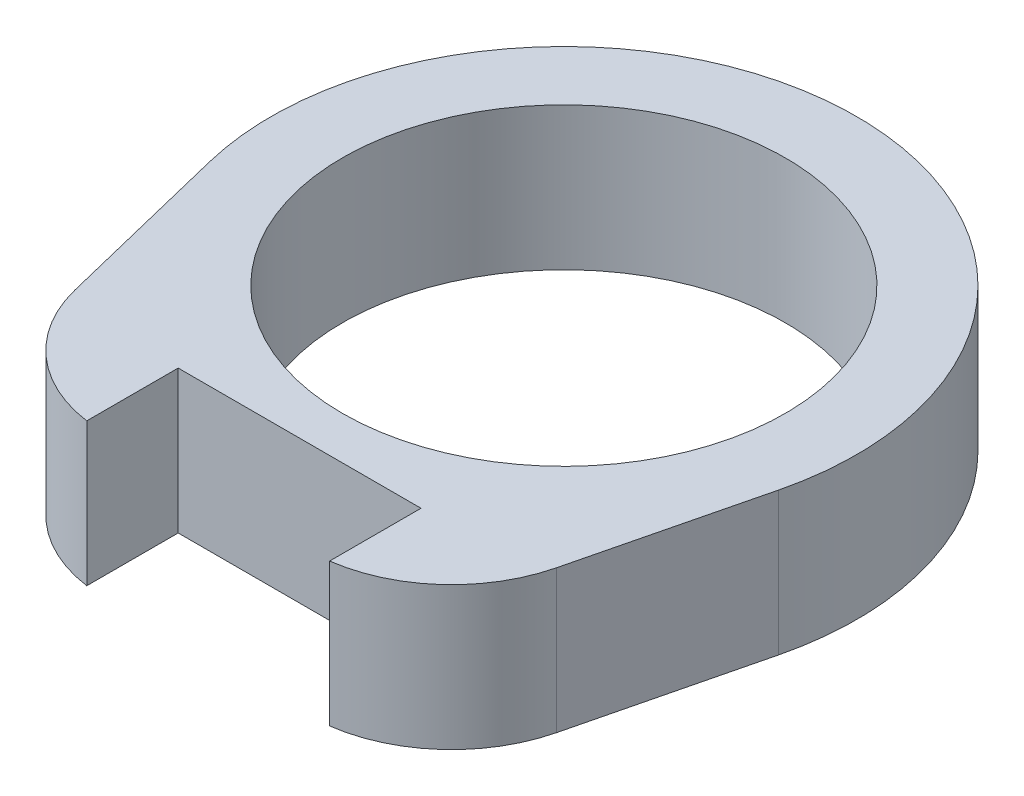
ISO-10303-21;
HEADER;
FILE_DESCRIPTION(('STEP AP214'),'2;1');
FILE_NAME('part.step','',(''),(''),'','','');
FILE_SCHEMA(('AUTOMOTIVE_DESIGN { 1 0 10303 214 1 1 1 1 }'));
ENDSEC;
DATA;
#1=APPLICATION_CONTEXT('core data for automotive mechanical design processes');
#2=APPLICATION_PROTOCOL_DEFINITION('international standard','automotive_design',2000,#1);
#3=PRODUCT_CONTEXT('',#1,'mechanical');
#4=PRODUCT('Part','Part','',(#3));
#5=PRODUCT_RELATED_PRODUCT_CATEGORY('part','',(#4));
#6=PRODUCT_DEFINITION_FORMATION('','',#4);
#7=PRODUCT_DEFINITION_CONTEXT('part definition',#1,'design');
#8=PRODUCT_DEFINITION('design','',#6,#7);
#9=PRODUCT_DEFINITION_SHAPE('','',#8);
#10=(LENGTH_UNIT() NAMED_UNIT(*) SI_UNIT(.MILLI.,.METRE.));
#11=(NAMED_UNIT(*) PLANE_ANGLE_UNIT() SI_UNIT($,.RADIAN.));
#12=(NAMED_UNIT(*) SI_UNIT($,.STERADIAN.) SOLID_ANGLE_UNIT());
#13=UNCERTAINTY_MEASURE_WITH_UNIT(LENGTH_MEASURE(1.E-05),#10,'distance_accuracy_value','');
#14=(GEOMETRIC_REPRESENTATION_CONTEXT(3) GLOBAL_UNCERTAINTY_ASSIGNED_CONTEXT((#13)) GLOBAL_UNIT_ASSIGNED_CONTEXT((#10,
#11,#12)) REPRESENTATION_CONTEXT('',''));
#15=CARTESIAN_POINT('',(0.,0.,0.));
#16=DIRECTION('',(0.,0.,1.));
#17=DIRECTION('',(1.,0.,0.));
#18=AXIS2_PLACEMENT_3D('',#15,#16,#17);
#19=CARTESIAN_POINT('',(-8.5,0.,24.9));
#20=DIRECTION('',(-1.,0.,0.));
#21=DIRECTION('',(0.,0.,-1.));
#22=AXIS2_PLACEMENT_3D('',#19,#20,#21);
#23=PLANE('',#22);
#24=DIRECTION('',(0.,1.,0.));
#25=VECTOR('',#24,1.);
#26=CARTESIAN_POINT('',(-8.5,0.,24.9));
#27=LINE('',#26,#25);
#28=CARTESIAN_POINT('',(-8.5,-10.,24.9));
#29=VERTEX_POINT('',#28);
#30=CARTESIAN_POINT('',(-8.5,0.,24.9));
#31=VERTEX_POINT('',#30);
#32=EDGE_CURVE('E11',#29,#31,#27,.T.);
#33=ORIENTED_EDGE('',*,*,#32,.F.);
#34=DIRECTION('',(0.,0.,-1.));
#35=VECTOR('',#34,1.);
#36=CARTESIAN_POINT('',(-8.5,-10.,0.));
#37=LINE('',#36,#35);
#38=CARTESIAN_POINT('',(-8.5,-10.,18.5));
#39=VERTEX_POINT('',#38);
#40=EDGE_CURVE('E113',#29,#39,#37,.T.);
#41=ORIENTED_EDGE('',*,*,#40,.T.);
#42=DIRECTION('',(0.,1.,0.));
#43=VECTOR('',#42,1.);
#44=CARTESIAN_POINT('',(-8.5,0.,18.5));
#45=LINE('',#44,#43);
#46=CARTESIAN_POINT('',(-8.5,0.,18.5));
#47=VERTEX_POINT('',#46);
#48=EDGE_CURVE('E55',#39,#47,#45,.T.);
#49=ORIENTED_EDGE('',*,*,#48,.T.);
#50=DIRECTION('',(0.,0.,-1.));
#51=VECTOR('',#50,1.);
#52=CARTESIAN_POINT('',(-8.5,0.,24.9));
#53=LINE('',#52,#51);
#54=EDGE_CURVE('E171',#31,#47,#53,.T.);
#55=ORIENTED_EDGE('',*,*,#54,.F.);
#56=EDGE_LOOP('',(#33,#41,#49,#55));
#57=FACE_BOUND('',#56,.T.);
#58=ADVANCED_FACE('F44',(#57),#23,.F.);
#59=CARTESIAN_POINT('',(-8.5,0.,18.5));
#60=DIRECTION('',(0.,0.,-1.));
#61=DIRECTION('',(1.,0.,0.));
#62=AXIS2_PLACEMENT_3D('',#59,#60,#61);
#63=PLANE('',#62);
#64=ORIENTED_EDGE('',*,*,#48,.F.);
#65=DIRECTION('',(1.,0.,0.));
#66=VECTOR('',#65,1.);
#67=CARTESIAN_POINT('',(0.,-10.,18.5));
#68=LINE('',#67,#66);
#69=CARTESIAN_POINT('',(8.5,-10.,18.5));
#70=VERTEX_POINT('',#69);
#71=EDGE_CURVE('E142',#39,#70,#68,.T.);
#72=ORIENTED_EDGE('',*,*,#71,.T.);
#73=DIRECTION('',(0.,1.,0.));
#74=VECTOR('',#73,1.);
#75=CARTESIAN_POINT('',(8.5,0.,18.5));
#76=LINE('',#75,#74);
#77=CARTESIAN_POINT('',(8.5,0.,18.5));
#78=VERTEX_POINT('',#77);
#79=EDGE_CURVE('E161',#70,#78,#76,.T.);
#80=ORIENTED_EDGE('',*,*,#79,.T.);
#81=DIRECTION('',(1.,0.,0.));
#82=VECTOR('',#81,1.);
#83=CARTESIAN_POINT('',(-8.5,0.,18.5));
#84=LINE('',#83,#82);
#85=EDGE_CURVE('E180',#47,#78,#84,.T.);
#86=ORIENTED_EDGE('',*,*,#85,.F.);
#87=EDGE_LOOP('',(#64,#72,#80,#86));
#88=FACE_BOUND('',#87,.T.);
#89=ADVANCED_FACE('F184',(#88),#63,.F.);
#90=CARTESIAN_POINT('',(8.5,0.,18.5));
#91=DIRECTION('',(1.,0.,0.));
#92=DIRECTION('',(0.,0.,1.));
#93=AXIS2_PLACEMENT_3D('',#90,#91,#92);
#94=PLANE('',#93);
#95=ORIENTED_EDGE('',*,*,#79,.F.);
#96=DIRECTION('',(0.,0.,-1.));
#97=VECTOR('',#96,1.);
#98=CARTESIAN_POINT('',(8.5,-10.,0.));
#99=LINE('',#98,#97);
#100=CARTESIAN_POINT('',(8.5,-10.,24.9));
#101=VERTEX_POINT('',#100);
#102=EDGE_CURVE('E138',#70,#101,#99,.F.);
#103=ORIENTED_EDGE('',*,*,#102,.T.);
#104=DIRECTION('',(0.,1.,0.));
#105=VECTOR('',#104,1.);
#106=CARTESIAN_POINT('',(8.5,0.,24.9));
#107=LINE('',#106,#105);
#108=CARTESIAN_POINT('',(8.5,0.,24.9));
#109=VERTEX_POINT('',#108);
#110=EDGE_CURVE('E157',#101,#109,#107,.T.);
#111=ORIENTED_EDGE('',*,*,#110,.T.);
#112=DIRECTION('',(0.,0.,1.));
#113=VECTOR('',#112,1.);
#114=CARTESIAN_POINT('',(8.5,0.,18.5));
#115=LINE('',#114,#113);
#116=EDGE_CURVE('E186',#78,#109,#115,.T.);
#117=ORIENTED_EDGE('',*,*,#116,.F.);
#118=EDGE_LOOP('',(#95,#103,#111,#117));
#119=FACE_BOUND('',#118,.T.);
#120=ADVANCED_FACE('F216',(#119),#94,.F.);
#121=CARTESIAN_POINT('',(7.13344069003477,0.,14.9938142732761));
#122=DIRECTION('',(0.,-1.,0.));
#123=DIRECTION('',(0.,0.,-1.));
#124=AXIS2_PLACEMENT_3D('',#121,#122,#123);
#125=CYLINDRICAL_SURFACE('',#124,10.);
#126=ORIENTED_EDGE('',*,*,#110,.F.);
#127=CARTESIAN_POINT('',(7.13344069003477,-10.,14.9938142732761));
#128=DIRECTION('',(0.,-1.,0.));
#129=DIRECTION('',(0.,0.,-1.));
#130=AXIS2_PLACEMENT_3D('',#127,#128,#129);
#131=CIRCLE('',#130,10.);
#132=CARTESIAN_POINT('',(16.8455351105988,-10.,17.3760867106874));
#133=VERTEX_POINT('',#132);
#134=EDGE_CURVE('E134',#101,#133,#131,.F.);
#135=ORIENTED_EDGE('',*,*,#134,.T.);
#136=DIRECTION('',(0.,1.,0.));
#137=VECTOR('',#136,1.);
#138=CARTESIAN_POINT('',(16.8455351105988,0.,17.3760867106874));
#139=LINE('',#138,#137);
#140=CARTESIAN_POINT('',(16.8455351105988,0.,17.3760867106874));
#141=VERTEX_POINT('',#140);
#142=EDGE_CURVE('E153',#133,#141,#139,.T.);
#143=ORIENTED_EDGE('',*,*,#142,.T.);
#144=CARTESIAN_POINT('',(7.13344069003477,0.,14.9938142732761));
#145=DIRECTION('',(0.,-1.,0.));
#146=DIRECTION('',(0.,0.,-1.));
#147=AXIS2_PLACEMENT_3D('',#144,#145,#146);
#148=CIRCLE('',#147,10.);
#149=EDGE_CURVE('E190',#109,#141,#148,.F.);
#150=ORIENTED_EDGE('',*,*,#149,.F.);
#151=EDGE_LOOP('',(#126,#135,#143,#150));
#152=FACE_BOUND('',#151,.T.);
#153=ADVANCED_FACE('F212',(#152),#125,.T.);
#154=CARTESIAN_POINT('',(15.,0.,24.9));
#155=DIRECTION('',(-0.971209442056402,0.,-0.238227243741123));
#156=DIRECTION('',(0.238227243741123,0.,-0.971209442056402));
#157=AXIS2_PLACEMENT_3D('',#154,#155,#156);
#158=PLANE('',#157);
#159=ORIENTED_EDGE('',*,*,#142,.F.);
#160=DIRECTION('',(0.238227243741123,0.,-0.971209442056402));
#161=VECTOR('',#160,1.);
#162=CARTESIAN_POINT('',(15.,-10.,24.9));
#163=LINE('',#162,#161);
#164=CARTESIAN_POINT('',(19.9097935621562,-10.,4.88365849669303));
#165=VERTEX_POINT('',#164);
#166=EDGE_CURVE('E130',#133,#165,#163,.T.);
#167=ORIENTED_EDGE('',*,*,#166,.T.);
#168=DIRECTION('',(0.,1.,0.));
#169=VECTOR('',#168,1.);
#170=CARTESIAN_POINT('',(19.9097935621562,0.,4.88365849669303));
#171=LINE('',#170,#169);
#172=CARTESIAN_POINT('',(19.9097935621562,0.,4.88365849669303));
#173=VERTEX_POINT('',#172);
#174=EDGE_CURVE('E150',#165,#173,#171,.T.);
#175=ORIENTED_EDGE('',*,*,#174,.T.);
#176=DIRECTION('',(0.238227243741123,0.,-0.971209442056402));
#177=VECTOR('',#176,1.);
#178=CARTESIAN_POINT('',(15.,0.,24.9));
#179=LINE('',#178,#177);
#180=EDGE_CURVE('E197',#141,#173,#179,.T.);
#181=ORIENTED_EDGE('',*,*,#180,.F.);
#182=EDGE_LOOP('',(#159,#167,#175,#181));
#183=FACE_BOUND('',#182,.T.);
#184=ADVANCED_FACE('F208',(#183),#158,.F.);
#185=CARTESIAN_POINT('',(0.,0.,0.));
#186=DIRECTION('',(0.,-1.,0.));
#187=DIRECTION('',(0.,0.,-1.));
#188=AXIS2_PLACEMENT_3D('',#185,#186,#187);
#189=CYLINDRICAL_SURFACE('',#188,20.5);
#190=ORIENTED_EDGE('',*,*,#174,.F.);
#191=CARTESIAN_POINT('',(0.,-10.,0.));
#192=DIRECTION('',(0.,1.,0.));
#193=DIRECTION('',(0.,0.,1.));
#194=AXIS2_PLACEMENT_3D('',#191,#192,#193);
#195=CIRCLE('',#194,20.5);
#196=CARTESIAN_POINT('',(-19.9097935621562,-10.,4.88365849669303));
#197=VERTEX_POINT('',#196);
#198=EDGE_CURVE('E126',#165,#197,#195,.T.);
#199=ORIENTED_EDGE('',*,*,#198,.T.);
#200=DIRECTION('',(0.,1.,0.));
#201=VECTOR('',#200,1.);
#202=CARTESIAN_POINT('',(-19.9097935621562,0.,4.88365849669303));
#203=LINE('',#202,#201);
#204=CARTESIAN_POINT('',(-19.9097935621562,0.,4.88365849669303));
#205=VERTEX_POINT('',#204);
#206=EDGE_CURVE('E63',#197,#205,#203,.T.);
#207=ORIENTED_EDGE('',*,*,#206,.T.);
#208=CARTESIAN_POINT('',(0.,0.,0.));
#209=DIRECTION('',(0.,1.,0.));
#210=DIRECTION('',(0.,0.,-1.));
#211=AXIS2_PLACEMENT_3D('',#208,#209,#210);
#212=CIRCLE('',#211,20.5);
#213=EDGE_CURVE('E106',#173,#205,#212,.T.);
#214=ORIENTED_EDGE('',*,*,#213,.F.);
#215=EDGE_LOOP('',(#190,#199,#207,#214));
#216=FACE_BOUND('',#215,.T.);
#217=ADVANCED_FACE('F205',(#216),#189,.T.);
#218=CARTESIAN_POINT('',(-15.,0.,24.9));
#219=DIRECTION('',(0.971209442056402,0.,-0.238227243741123));
#220=DIRECTION('',(0.238227243741123,0.,0.971209442056402));
#221=AXIS2_PLACEMENT_3D('',#218,#219,#220);
#222=PLANE('',#221);
#223=ORIENTED_EDGE('',*,*,#206,.F.);
#224=DIRECTION('',(0.238227243741123,0.,0.971209442056402));
#225=VECTOR('',#224,1.);
#226=CARTESIAN_POINT('',(-15.,-10.,24.9));
#227=LINE('',#226,#225);
#228=CARTESIAN_POINT('',(-16.8455351105988,-10.,17.3760867106874));
#229=VERTEX_POINT('',#228);
#230=EDGE_CURVE('E111',#197,#229,#227,.T.);
#231=ORIENTED_EDGE('',*,*,#230,.T.);
#232=DIRECTION('',(0.,1.,0.));
#233=VECTOR('',#232,1.);
#234=CARTESIAN_POINT('',(-16.8455351105988,0.,17.3760867106874));
#235=LINE('',#234,#233);
#236=CARTESIAN_POINT('',(-16.8455351105988,0.,17.3760867106874));
#237=VERTEX_POINT('',#236);
#238=EDGE_CURVE('E48',#229,#237,#235,.T.);
#239=ORIENTED_EDGE('',*,*,#238,.T.);
#240=DIRECTION('',(0.238227243741123,0.,0.971209442056402));
#241=VECTOR('',#240,1.);
#242=CARTESIAN_POINT('',(-15.,0.,24.9));
#243=LINE('',#242,#241);
#244=EDGE_CURVE('E203',#205,#237,#243,.T.);
#245=ORIENTED_EDGE('',*,*,#244,.F.);
#246=EDGE_LOOP('',(#223,#231,#239,#245));
#247=FACE_BOUND('',#246,.T.);
#248=ADVANCED_FACE('F116',(#247),#222,.F.);
#249=CARTESIAN_POINT('',(0.,0.,0.));
#250=DIRECTION('',(0.,-1.,0.));
#251=DIRECTION('',(0.,0.,-1.));
#252=AXIS2_PLACEMENT_3D('',#249,#250,#251);
#253=CYLINDRICAL_SURFACE('',#252,15.5);
#254=CARTESIAN_POINT('',(0.,0.,0.));
#255=DIRECTION('',(0.,1.,0.));
#256=DIRECTION('',(0.,0.,1.));
#257=AXIS2_PLACEMENT_3D('',#254,#255,#256);
#258=CIRCLE('',#257,15.5);
#259=CARTESIAN_POINT('',(0.,0.,15.5));
#260=VERTEX_POINT('',#259);
#261=EDGE_CURVE('E129',#260,#260,#258,.T.);
#262=ORIENTED_EDGE('',*,*,#261,.T.);
#263=EDGE_LOOP('',(#262));
#264=FACE_BOUND('',#263,.T.);
#265=CARTESIAN_POINT('',(0.,-10.,0.));
#266=DIRECTION('',(0.,1.,0.));
#267=DIRECTION('',(0.,0.,1.));
#268=AXIS2_PLACEMENT_3D('',#265,#266,#267);
#269=CIRCLE('',#268,15.5);
#270=CARTESIAN_POINT('',(0.,-10.,15.5));
#271=VERTEX_POINT('',#270);
#272=EDGE_CURVE('E118',#271,#271,#269,.T.);
#273=ORIENTED_EDGE('',*,*,#272,.F.);
#274=EDGE_LOOP('',(#273));
#275=FACE_BOUND('',#274,.T.);
#276=ADVANCED_FACE('F272',(#264,#275),#253,.F.);
#277=CARTESIAN_POINT('',(-7.13344069003477,0.,14.9938142732761));
#278=DIRECTION('',(0.,-1.,0.));
#279=DIRECTION('',(0.,0.,-1.));
#280=AXIS2_PLACEMENT_3D('',#277,#278,#279);
#281=CYLINDRICAL_SURFACE('',#280,10.);
#282=CARTESIAN_POINT('',(-7.13344069003477,-10.,14.9938142732761));
#283=DIRECTION('',(0.,-1.,0.));
#284=DIRECTION('',(0.,0.,-1.));
#285=AXIS2_PLACEMENT_3D('',#282,#283,#284);
#286=CIRCLE('',#285,10.);
#287=EDGE_CURVE('E99',#229,#29,#286,.F.);
#288=ORIENTED_EDGE('',*,*,#287,.T.);
#289=ORIENTED_EDGE('',*,*,#32,.T.);
#290=CARTESIAN_POINT('',(-7.13344069003477,0.,14.9938142732761));
#291=DIRECTION('',(0.,-1.,0.));
#292=DIRECTION('',(0.,0.,-1.));
#293=AXIS2_PLACEMENT_3D('',#290,#291,#292);
#294=CIRCLE('',#293,10.);
#295=EDGE_CURVE('E101',#237,#31,#294,.F.);
#296=ORIENTED_EDGE('',*,*,#295,.F.);
#297=ORIENTED_EDGE('',*,*,#238,.F.);
#298=EDGE_LOOP('',(#288,#289,#296,#297));
#299=FACE_BOUND('',#298,.T.);
#300=ADVANCED_FACE('F46',(#299),#281,.T.);
#301=CARTESIAN_POINT('',(0.,0.,0.));
#302=DIRECTION('',(0.,-1.,0.));
#303=DIRECTION('',(0.,0.,-1.));
#304=AXIS2_PLACEMENT_3D('',#301,#302,#303);
#305=PLANE('',#304);
#306=ORIENTED_EDGE('',*,*,#261,.F.);
#307=EDGE_LOOP('',(#306));
#308=FACE_BOUND('',#307,.T.);
#309=ORIENTED_EDGE('',*,*,#244,.T.);
#310=ORIENTED_EDGE('',*,*,#295,.T.);
#311=ORIENTED_EDGE('',*,*,#54,.T.);
#312=ORIENTED_EDGE('',*,*,#85,.T.);
#313=ORIENTED_EDGE('',*,*,#116,.T.);
#314=ORIENTED_EDGE('',*,*,#149,.T.);
#315=ORIENTED_EDGE('',*,*,#180,.T.);
#316=ORIENTED_EDGE('',*,*,#213,.T.);
#317=EDGE_LOOP('',(#309,#310,#311,#312,#313,#314,#315,#316));
#318=FACE_BOUND('',#317,.T.);
#319=ADVANCED_FACE('F178',(#308,#318),#305,.F.);
#320=CARTESIAN_POINT('',(0.,-10.,0.));
#321=DIRECTION('',(0.,-1.,0.));
#322=DIRECTION('',(0.,0.,-1.));
#323=AXIS2_PLACEMENT_3D('',#320,#321,#322);
#324=PLANE('',#323);
#325=ORIENTED_EDGE('',*,*,#272,.T.);
#326=EDGE_LOOP('',(#325));
#327=FACE_BOUND('',#326,.T.);
#328=ORIENTED_EDGE('',*,*,#230,.F.);
#329=ORIENTED_EDGE('',*,*,#198,.F.);
#330=ORIENTED_EDGE('',*,*,#166,.F.);
#331=ORIENTED_EDGE('',*,*,#134,.F.);
#332=ORIENTED_EDGE('',*,*,#102,.F.);
#333=ORIENTED_EDGE('',*,*,#71,.F.);
#334=ORIENTED_EDGE('',*,*,#40,.F.);
#335=ORIENTED_EDGE('',*,*,#287,.F.);
#336=EDGE_LOOP('',(#328,#329,#330,#331,#332,#333,#334,#335));
#337=FACE_BOUND('',#336,.T.);
#338=ADVANCED_FACE('F109',(#327,#337),#324,.T.);
#339=CLOSED_SHELL('',(#58,#89,#120,#153,#184,#217,#248,#276,#300,#319,#338));
#340=MANIFOLD_SOLID_BREP('B2',#339);
#341=ADVANCED_BREP_SHAPE_REPRESENTATION('',(#18,#340),#14);
#342=SHAPE_DEFINITION_REPRESENTATION(#9,#341);
ENDSEC;
END-ISO-10303-21;
